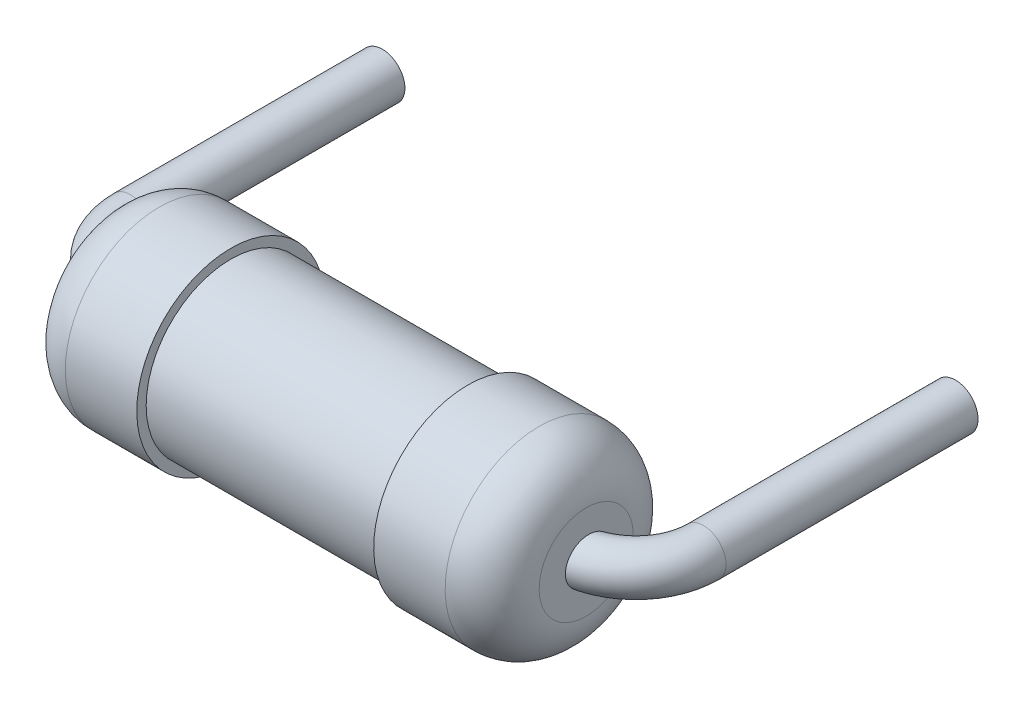
ISO-10303-21;
HEADER;
FILE_DESCRIPTION(('STEP AP214'),'2;1');
FILE_NAME('part.step','',(''),(''),'','','');
FILE_SCHEMA(('AUTOMOTIVE_DESIGN { 1 0 10303 214 1 1 1 1 }'));
ENDSEC;
DATA;
#1=APPLICATION_CONTEXT('core data for automotive mechanical design processes');
#2=APPLICATION_PROTOCOL_DEFINITION('international standard','automotive_design',2000,#1);
#3=PRODUCT_CONTEXT('',#1,'mechanical');
#4=PRODUCT('Part','Part','',(#3));
#5=PRODUCT_RELATED_PRODUCT_CATEGORY('part','',(#4));
#6=PRODUCT_DEFINITION_FORMATION('','',#4);
#7=PRODUCT_DEFINITION_CONTEXT('part definition',#1,'design');
#8=PRODUCT_DEFINITION('design','',#6,#7);
#9=PRODUCT_DEFINITION_SHAPE('','',#8);
#10=(LENGTH_UNIT() NAMED_UNIT(*) SI_UNIT(.MILLI.,.METRE.));
#11=(NAMED_UNIT(*) PLANE_ANGLE_UNIT() SI_UNIT($,.RADIAN.));
#12=(NAMED_UNIT(*) SI_UNIT($,.STERADIAN.) SOLID_ANGLE_UNIT());
#13=UNCERTAINTY_MEASURE_WITH_UNIT(LENGTH_MEASURE(1.E-05),#10,'distance_accuracy_value','');
#14=(GEOMETRIC_REPRESENTATION_CONTEXT(3) GLOBAL_UNCERTAINTY_ASSIGNED_CONTEXT((#13)) GLOBAL_UNIT_ASSIGNED_CONTEXT((#10,
#11,#12)) REPRESENTATION_CONTEXT('',''));
#15=CARTESIAN_POINT('',(0.,0.,0.));
#16=DIRECTION('',(0.,0.,1.));
#17=DIRECTION('',(1.,0.,0.));
#18=AXIS2_PLACEMENT_3D('',#15,#16,#17);
#19=CARTESIAN_POINT('',(7.32,0.,-3.));
#20=DIRECTION('',(0.,0.,1.));
#21=DIRECTION('',(1.,0.,0.));
#22=AXIS2_PLACEMENT_3D('',#19,#20,#21);
#23=PLANE('',#22);
#24=CARTESIAN_POINT('',(7.62,0.,-3.));
#25=DIRECTION('',(0.,0.,-1.));
#26=DIRECTION('',(-1.,0.,0.));
#27=AXIS2_PLACEMENT_3D('',#24,#25,#26);
#28=CIRCLE('',#27,0.3);
#29=CARTESIAN_POINT('',(7.32,0.,-3.));
#30=VERTEX_POINT('',#29);
#31=EDGE_CURVE('E11',#30,#30,#28,.T.);
#32=ORIENTED_EDGE('',*,*,#31,.T.);
#33=EDGE_LOOP('',(#32));
#34=FACE_BOUND('',#33,.T.);
#35=ADVANCED_FACE('F17',(#34),#23,.F.);
#36=CARTESIAN_POINT('',(7.62,0.,0.35));
#37=DIRECTION('',(0.,0.,-1.));
#38=DIRECTION('',(-1.,0.,0.));
#39=AXIS2_PLACEMENT_3D('',#36,#37,#38);
#40=CYLINDRICAL_SURFACE('',#39,0.3);
#41=DIRECTION('',(0.,0.,-1.));
#42=VECTOR('',#41,1.);
#43=CARTESIAN_POINT('',(7.32,0.,0.35));
#44=LINE('',#43,#42);
#45=CARTESIAN_POINT('',(7.32,0.,0.35));
#46=VERTEX_POINT('',#45);
#47=EDGE_CURVE('E25',#46,#30,#44,.T.);
#48=ORIENTED_EDGE('',*,*,#47,.T.);
#49=ORIENTED_EDGE('',*,*,#31,.F.);
#50=ORIENTED_EDGE('',*,*,#47,.F.);
#51=CARTESIAN_POINT('',(7.62,0.,0.35));
#52=DIRECTION('',(0.,0.,1.));
#53=DIRECTION('',(1.,0.,0.));
#54=AXIS2_PLACEMENT_3D('',#51,#52,#53);
#55=CIRCLE('',#54,0.3);
#56=EDGE_CURVE('E162',#46,#46,#55,.T.);
#57=ORIENTED_EDGE('',*,*,#56,.F.);
#58=EDGE_LOOP('',(#48,#49,#50,#57));
#59=FACE_BOUND('',#58,.T.);
#60=ADVANCED_FACE('F190',(#59),#40,.T.);
#61=CARTESIAN_POINT('',(6.72,0.,0.35));
#62=DIRECTION('',(0.,1.,0.));
#63=DIRECTION('',(0.,0.,1.));
#64=AXIS2_PLACEMENT_3D('',#61,#62,#63);
#65=TOROIDAL_SURFACE('',#64,0.9,0.3);
#66=CARTESIAN_POINT('',(6.96,0.,0.899909083395));
#67=CARTESIAN_POINT('',(6.96,-0.009860167462582,0.89990896861));
#68=CARTESIAN_POINT('',(6.96,-0.0196044152314,0.900333777569));
#69=CARTESIAN_POINT('',(6.96,-0.02906856746895,0.901162791225));
#70=CARTESIAN_POINT('',(6.96,-0.03818494668051,0.902337445313));
#71=CARTESIAN_POINT('',(6.96,-0.04697397432956,0.903804960014));
#72=CARTESIAN_POINT('',(6.96,-0.0654122858756,0.907588661461));
#73=CARTESIAN_POINT('',(6.96,-0.07491985816654,0.909985989386));
#74=CARTESIAN_POINT('',(6.96,-0.08408849098391,0.912709553602));
#75=CARTESIAN_POINT('',(6.96,-0.09294310465939,0.915726321464));
#76=CARTESIAN_POINT('',(6.96,-0.10150496885,0.919011549987));
#77=CARTESIAN_POINT('',(6.96,-0.118958221281,0.926453836747));
#78=CARTESIAN_POINT('',(6.96,-0.127787715696,0.930666010737));
#79=CARTESIAN_POINT('',(6.96,-0.136306161655,0.935155928941));
#80=CARTESIAN_POINT('',(6.96,-0.144532121634,0.939904049757));
#81=CARTESIAN_POINT('',(6.96,-0.152479877126,0.944895641374));
#82=CARTESIAN_POINT('',(6.96,-0.168328600516,0.955672815412));
#83=CARTESIAN_POINT('',(6.96,-0.176194773963,0.961488214941));
#84=CARTESIAN_POINT('',(6.96,-0.183772608747,0.967551566344));
#85=CARTESIAN_POINT('',(6.96,-0.191071765541,0.973851742068));
#86=CARTESIAN_POINT('',(6.96,-0.198098606692,0.980379951052));
#87=CARTESIAN_POINT('',(6.96,-0.211800202804,0.994065659178));
#88=CARTESIAN_POINT('',(6.96,-0.218460270558,1.001234983766));
#89=CARTESIAN_POINT('',(6.96,-0.224839910615,1.00863041136));
#90=CARTESIAN_POINT('',(6.96,-0.230940211566,1.016245364777));
#91=CARTESIAN_POINT('',(6.96,-0.236759839456,1.024073990789));
#92=CARTESIAN_POINT('',(6.96,-0.247832003876,1.040150861324));
#93=CARTESIAN_POINT('',(6.96,-0.253084568675,1.048398903269));
#94=CARTESIAN_POINT('',(6.96,-0.258049049185,1.05685004652));
#95=CARTESIAN_POINT('',(6.96,-0.2627200155,1.065498685566));
#96=CARTESIAN_POINT('',(6.96,-0.267090290802,1.074338848812));
#97=CARTESIAN_POINT('',(6.96,-0.275134913375,1.092219064394));
#98=CARTESIAN_POINT('',(6.96,-0.278821000575,1.10125194666));
#99=CARTESIAN_POINT('',(6.96,-0.282200788118,1.110456818481));
#100=CARTESIAN_POINT('',(6.96,-0.285264726102,1.119826534893));
#101=CARTESIAN_POINT('',(6.96,-0.288002139566,1.129352832871));
#102=CARTESIAN_POINT('',(6.96,-0.292725370416,1.148397637921));
#103=CARTESIAN_POINT('',(6.96,-0.29473215882,1.157906911838));
#104=CARTESIAN_POINT('',(6.96,-0.296410834199,1.16754558505));
#105=CARTESIAN_POINT('',(6.96,-0.297750172302,1.177303521997));
#106=CARTESIAN_POINT('',(6.96,-0.298738484134,1.187169019587));
#107=CARTESIAN_POINT('',(6.96,-0.29996489055,1.20670853133));
#108=CARTESIAN_POINT('',(6.96,-0.300230362775,1.216375375657));
#109=CARTESIAN_POINT('',(6.96,-0.300149187552,1.22611747583));
#110=CARTESIAN_POINT('',(6.96,-0.299710732489,1.235921267953));
#111=CARTESIAN_POINT('',(6.96,-0.298904577874,1.245771488577));
#112=CARTESIAN_POINT('',(6.96,-0.296585075031,1.265125180201));
#113=CARTESIAN_POINT('',(6.96,-0.295102319855,1.27462625024));
#114=CARTESIAN_POINT('',(6.96,-0.293263243612,1.284139361954));
#115=CARTESIAN_POINT('',(6.96,-0.29105964956,1.293647958229));
#116=CARTESIAN_POINT('',(6.96,-0.288484151749,1.303133947704));
#117=CARTESIAN_POINT('',(6.96,-0.282698057797,1.321631888118));
#118=CARTESIAN_POINT('',(6.96,-0.279518212828,1.330647292743));
#119=CARTESIAN_POINT('',(6.96,-0.275984865526,1.339606568389));
#120=CARTESIAN_POINT('',(6.96,-0.27209347283,1.348491205415));
#121=CARTESIAN_POINT('',(6.96,-0.26784072321,1.357281534804));
#122=CARTESIAN_POINT('',(6.96,-0.258792456003,1.374285939199));
#123=CARTESIAN_POINT('',(6.96,-0.254025471274,1.382509099941));
#124=CARTESIAN_POINT('',(6.96,-0.248921774536,1.390607746147));
#125=CARTESIAN_POINT('',(6.96,-0.24348099529,1.398562707415));
#126=CARTESIAN_POINT('',(6.96,-0.237704200488,1.406354107177));
#127=CARTESIAN_POINT('',(6.96,-0.225715116467,1.421280374005));
#128=CARTESIAN_POINT('',(6.96,-0.219527700064,1.428429026844));
#129=CARTESIAN_POINT('',(6.96,-0.213033898729,1.435388985848));
#130=CARTESIAN_POINT('',(6.96,-0.206237442407,1.442141620875));
#131=CARTESIAN_POINT('',(6.96,-0.199143537578,1.448668007007));
#132=CARTESIAN_POINT('',(6.96,-0.184639358866,1.461004311837));
#133=CARTESIAN_POINT('',(6.96,-0.177249661366,1.46683162664));
#134=CARTESIAN_POINT('',(6.96,-0.169595743404,1.472413651413));
#135=CARTESIAN_POINT('',(6.96,-0.161685063001,1.477733185029));
#136=CARTESIAN_POINT('',(6.96,-0.153526567552,1.482773042789));
#137=CARTESIAN_POINT('',(6.96,-0.137020377957,1.492097733275));
#138=CARTESIAN_POINT('',(6.96,-0.128688741655,1.496402506097));
#139=CARTESIAN_POINT('',(6.96,-0.120145015698,1.500414870926));
#140=CARTESIAN_POINT('',(6.96,-0.111400273136,1.504119613979));
#141=CARTESIAN_POINT('',(6.96,-0.102467429294,1.507501811642));
#142=CARTESIAN_POINT('',(6.96,-0.08453487359643,1.513498183633));
#143=CARTESIAN_POINT('',(6.96,-0.07554644720911,1.51613308184));
#144=CARTESIAN_POINT('',(6.96,-0.06640854708582,1.518437839156));
#145=CARTESIAN_POINT('',(6.96,-0.05713780068804,1.520399910874));
#146=CARTESIAN_POINT('',(6.96,-0.04775487845774,1.522007893513));
#147=CARTESIAN_POINT('',(6.96,-0.02969292548283,1.52437977876));
#148=CARTESIAN_POINT('',(6.96,-0.02102889094976,1.525208924822));
#149=CARTESIAN_POINT('',(6.96,-0.01231404153143,1.525730890851));
#150=CARTESIAN_POINT('',(6.96,-0.003572679276074,1.525941220805));
#151=CARTESIAN_POINT('',(6.96,0.005168243033088,1.52583907475));
#152=CARTESIAN_POINT('',(6.96,0.02337844678287,1.524978413229));
#153=CARTESIAN_POINT('',(6.96,0.03284373024997,1.524160868463));
#154=CARTESIAN_POINT('',(6.96,0.04224172239025,1.522980299422));
#155=CARTESIAN_POINT('',(6.96,0.05154503802108,1.521444853212));
#156=CARTESIAN_POINT('',(6.96,0.06073215666605,1.519565119195));
#157=CARTESIAN_POINT('',(6.96,0.07909771199475,1.515080715405));
#158=CARTESIAN_POINT('',(6.96,0.0882675531125,1.512456387335));
#159=CARTESIAN_POINT('',(6.96,0.09727920151967,1.509494357792));
#160=CARTESIAN_POINT('',(6.96,0.106117302403,1.506208331254));
#161=CARTESIAN_POINT('',(6.96,0.114768890523,1.502612503667));
#162=CARTESIAN_POINT('',(6.96,0.1319661163,1.494697932395));
#163=CARTESIAN_POINT('',(6.96,0.140497712216,1.490358583428));
#164=CARTESIAN_POINT('',(6.96,0.148806071355,1.485719654426));
#165=CARTESIAN_POINT('',(6.96,0.156880646133,1.480797412311));
#166=CARTESIAN_POINT('',(6.96,0.164712447986,1.475608252032));
#167=CARTESIAN_POINT('',(6.96,0.180151425777,1.46453127229));
#168=CARTESIAN_POINT('',(6.96,0.187739967164,1.45862481836));
#169=CARTESIAN_POINT('',(6.96,0.195051332691,1.452467727028));
#170=CARTESIAN_POINT('',(6.96,0.20207865613,1.446078243141));
#171=CARTESIAN_POINT('',(6.96,0.208816543867,1.439474464151));
#172=CARTESIAN_POINT('',(6.96,0.221953238059,1.425612923524));
#173=CARTESIAN_POINT('',(6.96,0.228328994524,1.418339683896));
#174=CARTESIAN_POINT('',(6.96,0.234383964852,1.410874723556));
#175=CARTESIAN_POINT('',(6.96,0.240115238483,1.403237627432));
#176=CARTESIAN_POINT('',(6.96,0.245521373748,1.395447463058));
#177=CARTESIAN_POINT('',(6.96,0.25588986733,1.379276120213));
#178=CARTESIAN_POINT('',(6.96,0.260825161615,1.370883687614));
#179=CARTESIAN_POINT('',(6.96,0.265408347201,1.362366366749));
#180=CARTESIAN_POINT('',(6.96,0.269640836772,1.353744077057));
#181=CARTESIAN_POINT('',(6.96,0.273525389215,1.345035773446));
#182=CARTESIAN_POINT('',(6.96,0.280757370989,1.327109983642));
#183=CARTESIAN_POINT('',(6.96,0.284074778857,1.317886520225));
#184=CARTESIAN_POINT('',(6.96,0.28702301626,1.308609389122));
#185=CARTESIAN_POINT('',(6.96,0.289607785113,1.29929753334));
#186=CARTESIAN_POINT('',(6.96,0.291835806202,1.289968505808));
#187=CARTESIAN_POINT('',(6.96,0.295674983107,1.270905490066));
#188=CARTESIAN_POINT('',(6.96,0.297255138129,1.261171409814));
#189=CARTESIAN_POINT('',(6.96,0.298464076807,1.251454505978));
#190=CARTESIAN_POINT('',(6.96,0.299311079865,1.241771395371));
#191=CARTESIAN_POINT('',(6.96,0.299805916194,1.232137034265));
#192=CARTESIAN_POINT('',(6.96,0.300118111197,1.212595339038));
#193=CARTESIAN_POINT('',(6.96,0.299906304864,1.202693342182));
#194=CARTESIAN_POINT('',(6.96,0.299334986276,1.192873677979));
#195=CARTESIAN_POINT('',(6.96,0.298415549391,1.183149632812));
#196=CARTESIAN_POINT('',(6.96,0.29715921972,1.173532829284));
#197=CARTESIAN_POINT('',(6.96,0.293937801394,1.154190874));
#198=CARTESIAN_POINT('',(6.96,0.291948588365,1.144474495238));
#199=CARTESIAN_POINT('',(6.96,0.28962167445,1.134895115228));
#200=CARTESIAN_POINT('',(6.96,0.286968474246,1.125462408515));
#201=CARTESIAN_POINT('',(6.96,0.283999557728,1.116184698885));
#202=CARTESIAN_POINT('',(6.96,0.277365720041,1.097719338125));
#203=CARTESIAN_POINT('',(6.96,0.273684735103,1.088540329457));
#204=CARTESIAN_POINT('',(6.96,0.269692170683,1.079539418357));
#205=CARTESIAN_POINT('',(6.96,0.265397023465,1.070723360764));
#206=CARTESIAN_POINT('',(6.96,0.260806811571,1.062098183552));
#207=CARTESIAN_POINT('',(6.96,0.251004219697,1.045163947022));
#208=CARTESIAN_POINT('',(6.96,0.245786411547,1.036858741787));
#209=CARTESIAN_POINT('',(6.96,0.240280395782,1.028758943151));
#210=CARTESIAN_POINT('',(6.96,0.234490304979,1.02087012779));
#211=CARTESIAN_POINT('',(6.96,0.22841815861,1.013198074729));
#212=CARTESIAN_POINT('',(6.96,0.215801547815,0.998407234883));
#213=CARTESIAN_POINT('',(6.96,0.209264913083,0.99128247471));
#214=CARTESIAN_POINT('',(6.96,0.202454000094,0.984380026053));
#215=CARTESIAN_POINT('',(6.96,0.195365961507,0.977706983911));
#216=CARTESIAN_POINT('',(6.96,0.187995061392,0.971271997058));
#217=CARTESIAN_POINT('',(6.96,0.173012837564,0.959175029375));
#218=CARTESIAN_POINT('',(6.96,0.165426529007,0.953492099376));
#219=CARTESIAN_POINT('',(6.96,0.157566437944,0.948044934321));
#220=CARTESIAN_POINT('',(6.96,0.149421373308,0.942845601948));
#221=CARTESIAN_POINT('',(6.96,0.140976264593,0.937909781461));
#222=CARTESIAN_POINT('',(6.96,0.124148131162,0.928975627958));
#223=CARTESIAN_POINT('',(6.96,0.115814071992,0.924934439518));
#224=CARTESIAN_POINT('',(6.96,0.107194037794,0.921149181784));
#225=CARTESIAN_POINT('',(6.96,0.09826937450524,0.917639774974));
#226=CARTESIAN_POINT('',(6.96,0.08901696421491,0.914432828225));
#227=CARTESIAN_POINT('',(6.96,0.06762356037127,0.908046964389));
#228=CARTESIAN_POINT('',(6.96,0.05540377745077,0.905068595899));
#229=CARTESIAN_POINT('',(6.96,0.04253681255711,0.902629529668));
#230=CARTESIAN_POINT('',(6.96,0.02893994360873,0.900849442899));
#231=CARTESIAN_POINT('',(6.96,0.0146772221458,0.899909046356));
#232=CARTESIAN_POINT('',(6.96,0.,0.899909083395));
#233=(BOUNDED_CURVE() B_SPLINE_CURVE(6,(#66,#67,#68,#69,#70,#71,#72,#73,#74,#75,#76,#77,#78,#79,
#80,#81,#82,#83,#84,#85,#86,#87,#88,#89,#90,#91,#92,#93,#94,#95,#96,#97,#98,#99,#100,#101,#102,
#103,#104,#105,#106,#107,#108,#109,#110,#111,#112,#113,#114,#115,#116,#117,#118,#119,#120,#121,
#122,#123,#124,#125,#126,#127,#128,#129,#130,#131,#132,#133,#134,#135,#136,#137,#138,#139,#140,
#141,#142,#143,#144,#145,#146,#147,#148,#149,#150,#151,#152,#153,#154,#155,#156,#157,#158,#159,
#160,#161,#162,#163,#164,#165,#166,#167,#168,#169,#170,#171,#172,#173,#174,#175,#176,#177,#178,
#179,#180,#181,#182,#183,#184,#185,#186,#187,#188,#189,#190,#191,#192,#193,#194,#195,#196,#197,
#198,#199,#200,#201,#202,#203,#204,#205,#206,#207,#208,#209,#210,#211,#212,#213,#214,#215,#216,
#217,#218,#219,#220,#221,#222,#223,#224,#225,#226,#227,#228,#229,#230,#231,#232),.UNSPECIFIED.,
.T.,.F.) B_SPLINE_CURVE_WITH_KNOTS((7,5,5,5,5,5,5,5,5,5,5,5,5,5,5,5,5,5,5,5,5,5,5,5,5,5,5,5,5,5,
5,5,5,7),(0.,0.02522151735631,0.05431626764274,0.08648932873413,0.120698905604,0.15585219498,
0.191016701755,0.225517033144,0.258939642143,0.291086884381,0.32191412294,0.351469698498,
0.379846555914,0.407148198058,0.433469525493,0.458895614127,0.483540398702,0.505898369155,
0.530279933853,0.555348100008,0.581270886766,0.608136607836,0.636034631737,0.665066137875,
0.695331933304,0.726904811218,0.759787311372,0.793856187529,0.828799116201,0.864057997078,
0.898806507422,0.932001552493,0.962545077037,1.),
.UNSPECIFIED.) CURVE() GEOMETRIC_REPRESENTATION_ITEM() RATIONAL_B_SPLINE_CURVE((1.,1.,1.,1.,1.,
1.,1.,1.,1.,1.,1.,1.,1.,1.,1.,1.,1.,1.,1.,1.,1.,1.,1.,1.,1.,1.,1.,1.,1.,1.,1.,1.,1.,1.,1.,1.,1.,
1.,1.,1.,1.,1.,1.,1.,1.,1.,1.,1.,1.,1.,1.,1.,1.,1.,1.,1.,1.,1.,1.,1.,1.,1.,1.,1.,1.,1.,1.,1.,1.,
1.,1.,1.,1.,1.,1.,1.,1.,1.,1.,1.,1.,1.,1.,1.,1.,1.,1.,1.,1.,1.,1.,1.,1.,1.,1.,1.,1.,1.,1.,1.,1.,
1.,1.,1.,1.,1.,1.,1.,1.,1.,1.,1.,1.,1.,1.,1.,1.,1.,1.,1.,1.,1.,1.,1.,1.,1.,1.,1.,1.,1.,1.,1.,1.,
1.,1.,1.,1.,1.,1.,1.,1.,1.,1.,1.,1.,1.,1.,1.,1.,1.,1.,1.,1.,1.,1.,1.,1.,1.,1.,1.,1.,1.,1.,1.,1.,
1.,1.)) REPRESENTATION_ITEM(''));
#234=CARTESIAN_POINT('',(6.96,0.,0.899909083395));
#235=VERTEX_POINT('',#234);
#236=EDGE_CURVE('E173',#235,#235,#233,.T.);
#237=ORIENTED_EDGE('',*,*,#236,.F.);
#238=CARTESIAN_POINT('',(6.72,0.,0.35));
#239=DIRECTION('',(0.,1.,0.));
#240=DIRECTION('',(0.,0.,1.));
#241=AXIS2_PLACEMENT_3D('',#238,#239,#240);
#242=CIRCLE('',#241,0.6);
#243=EDGE_CURVE('E179',#235,#46,#242,.T.);
#244=ORIENTED_EDGE('',*,*,#243,.T.);
#245=ORIENTED_EDGE('',*,*,#56,.T.);
#246=ORIENTED_EDGE('',*,*,#243,.F.);
#247=EDGE_LOOP('',(#237,#244,#245,#246));
#248=FACE_BOUND('',#247,.T.);
#249=ADVANCED_FACE('F189',(#248),#65,.T.);
#250=CARTESIAN_POINT('',(6.96,1.25,1.25));
#251=DIRECTION('',(-1.,0.,0.));
#252=DIRECTION('',(0.,0.,1.));
#253=AXIS2_PLACEMENT_3D('',#250,#251,#252);
#254=PLANE('',#253);
#255=ORIENTED_EDGE('',*,*,#236,.T.);
#256=EDGE_LOOP('',(#255));
#257=FACE_BOUND('',#256,.T.);
#258=CARTESIAN_POINT('',(6.96,0.,1.25));
#259=DIRECTION('',(1.,0.,0.));
#260=DIRECTION('',(0.,1.,0.));
#261=AXIS2_PLACEMENT_3D('',#258,#259,#260);
#262=CIRCLE('',#261,0.625);
#263=CARTESIAN_POINT('',(6.96,0.625,1.25));
#264=VERTEX_POINT('',#263);
#265=EDGE_CURVE('E127',#264,#264,#262,.T.);
#266=ORIENTED_EDGE('',*,*,#265,.T.);
#267=EDGE_LOOP('',(#266));
#268=FACE_BOUND('',#267,.T.);
#269=ADVANCED_FACE('F198',(#257,#268),#254,.F.);
#270=CARTESIAN_POINT('',(6.335,0.,1.25));
#271=DIRECTION('',(1.,0.,0.));
#272=DIRECTION('',(0.,1.,0.));
#273=AXIS2_PLACEMENT_3D('',#270,#271,#272);
#274=DEGENERATE_TOROIDAL_SURFACE('',#273,0.625,0.625,.T.);
#275=CARTESIAN_POINT('',(6.335,0.625,1.25));
#276=DIRECTION('',(0.,0.,-1.));
#277=DIRECTION('',(0.,1.,0.));
#278=AXIS2_PLACEMENT_3D('',#275,#276,#277);
#279=CIRCLE('',#278,0.625);
#280=CARTESIAN_POINT('',(6.335,1.25,1.25));
#281=VERTEX_POINT('',#280);
#282=EDGE_CURVE('E124',#281,#264,#279,.T.);
#283=ORIENTED_EDGE('',*,*,#282,.F.);
#284=CARTESIAN_POINT('',(6.335,0.,1.25));
#285=DIRECTION('',(1.,0.,0.));
#286=DIRECTION('',(0.,1.,0.));
#287=AXIS2_PLACEMENT_3D('',#284,#285,#286);
#288=CIRCLE('',#287,1.25);
#289=EDGE_CURVE('E128',#281,#281,#288,.T.);
#290=ORIENTED_EDGE('',*,*,#289,.T.);
#291=ORIENTED_EDGE('',*,*,#282,.T.);
#292=ORIENTED_EDGE('',*,*,#265,.F.);
#293=EDGE_LOOP('',(#283,#290,#291,#292));
#294=FACE_BOUND('',#293,.T.);
#295=ADVANCED_FACE('F202',(#294),#274,.T.);
#296=CARTESIAN_POINT('',(0.3,0.,-3.));
#297=DIRECTION('',(0.,0.,-1.));
#298=DIRECTION('',(0.,-1.,0.));
#299=AXIS2_PLACEMENT_3D('',#296,#297,#298);
#300=PLANE('',#299);
#301=CARTESIAN_POINT('',(0.,0.,-3.));
#302=DIRECTION('',(0.,0.,1.));
#303=DIRECTION('',(1.,0.,0.));
#304=AXIS2_PLACEMENT_3D('',#301,#302,#303);
#305=CIRCLE('',#304,0.3);
#306=CARTESIAN_POINT('',(0.3,0.,-3.));
#307=VERTEX_POINT('',#306);
#308=EDGE_CURVE('E137',#307,#307,#305,.T.);
#309=ORIENTED_EDGE('',*,*,#308,.F.);
#310=EDGE_LOOP('',(#309));
#311=FACE_BOUND('',#310,.T.);
#312=ADVANCED_FACE('F206',(#311),#300,.T.);
#313=CARTESIAN_POINT('',(5.385,0.,1.25));
#314=DIRECTION('',(-1.,0.,0.));
#315=DIRECTION('',(0.,1.,0.));
#316=AXIS2_PLACEMENT_3D('',#313,#314,#315);
#317=CYLINDRICAL_SURFACE('',#316,1.25);
#318=CARTESIAN_POINT('',(5.385,0.,1.25));
#319=DIRECTION('',(1.,0.,0.));
#320=DIRECTION('',(0.,1.,0.));
#321=AXIS2_PLACEMENT_3D('',#318,#319,#320);
#322=CIRCLE('',#321,1.25);
#323=CARTESIAN_POINT('',(5.385,1.25,1.25));
#324=VERTEX_POINT('',#323);
#325=EDGE_CURVE('E138',#324,#324,#322,.T.);
#326=ORIENTED_EDGE('',*,*,#325,.T.);
#327=DIRECTION('',(1.,0.,0.));
#328=VECTOR('',#327,1.);
#329=CARTESIAN_POINT('',(5.385,1.25,1.25));
#330=LINE('',#329,#328);
#331=EDGE_CURVE('E144',#324,#281,#330,.T.);
#332=ORIENTED_EDGE('',*,*,#331,.T.);
#333=ORIENTED_EDGE('',*,*,#289,.F.);
#334=ORIENTED_EDGE('',*,*,#331,.F.);
#335=EDGE_LOOP('',(#326,#332,#333,#334));
#336=FACE_BOUND('',#335,.T.);
#337=ADVANCED_FACE('F212',(#336),#317,.T.);
#338=CARTESIAN_POINT('',(0.,0.,-3.));
#339=DIRECTION('',(0.,0.,1.));
#340=DIRECTION('',(1.,0.,0.));
#341=AXIS2_PLACEMENT_3D('',#338,#339,#340);
#342=CYLINDRICAL_SURFACE('',#341,0.3);
#343=DIRECTION('',(0.,0.,1.));
#344=VECTOR('',#343,1.);
#345=CARTESIAN_POINT('',(0.3,0.,-3.));
#346=LINE('',#345,#344);
#347=CARTESIAN_POINT('',(0.3,0.,0.35));
#348=VERTEX_POINT('',#347);
#349=EDGE_CURVE('E134',#307,#348,#346,.T.);
#350=ORIENTED_EDGE('',*,*,#349,.T.);
#351=CARTESIAN_POINT('',(0.,0.,0.35));
#352=DIRECTION('',(0.,0.,1.));
#353=DIRECTION('',(1.,0.,0.));
#354=AXIS2_PLACEMENT_3D('',#351,#352,#353);
#355=CIRCLE('',#354,0.3);
#356=EDGE_CURVE('E122',#348,#348,#355,.T.);
#357=ORIENTED_EDGE('',*,*,#356,.F.);
#358=ORIENTED_EDGE('',*,*,#349,.F.);
#359=ORIENTED_EDGE('',*,*,#308,.T.);
#360=EDGE_LOOP('',(#350,#357,#358,#359));
#361=FACE_BOUND('',#360,.T.);
#362=ADVANCED_FACE('F208',(#361),#342,.T.);
#363=CARTESIAN_POINT('',(5.385,1.25,1.25));
#364=DIRECTION('',(-1.,0.,0.));
#365=DIRECTION('',(0.,0.,1.));
#366=AXIS2_PLACEMENT_3D('',#363,#364,#365);
#367=PLANE('',#366);
#368=CARTESIAN_POINT('',(5.385,0.,1.25));
#369=DIRECTION('',(-1.,0.,0.));
#370=DIRECTION('',(0.,1.,0.));
#371=AXIS2_PLACEMENT_3D('',#368,#369,#370);
#372=CIRCLE('',#371,1.125);
#373=CARTESIAN_POINT('',(5.385,1.125,1.25));
#374=VERTEX_POINT('',#373);
#375=EDGE_CURVE('E123',#374,#374,#372,.T.);
#376=ORIENTED_EDGE('',*,*,#375,.F.);
#377=EDGE_LOOP('',(#376));
#378=FACE_BOUND('',#377,.T.);
#379=ORIENTED_EDGE('',*,*,#325,.F.);
#380=EDGE_LOOP('',(#379));
#381=FACE_BOUND('',#380,.T.);
#382=ADVANCED_FACE('F211',(#378,#381),#367,.T.);
#383=CARTESIAN_POINT('',(0.9,0.,0.35));
#384=DIRECTION('',(0.,1.,0.));
#385=DIRECTION('',(-1.,0.,0.));
#386=AXIS2_PLACEMENT_3D('',#383,#384,#385);
#387=TOROIDAL_SURFACE('',#386,0.9,0.3);
#388=ORIENTED_EDGE('',*,*,#356,.T.);
#389=CARTESIAN_POINT('',(0.9,0.,0.35));
#390=DIRECTION('',(0.,1.,0.));
#391=DIRECTION('',(-1.,0.,0.));
#392=AXIS2_PLACEMENT_3D('',#389,#390,#391);
#393=CIRCLE('',#392,0.6);
#394=CARTESIAN_POINT('',(0.66,0.,0.899909083395));
#395=VERTEX_POINT('',#394);
#396=EDGE_CURVE('E157',#348,#395,#393,.T.);
#397=ORIENTED_EDGE('',*,*,#396,.T.);
#398=CARTESIAN_POINT('',(0.66,0.,0.899909083395));
#399=CARTESIAN_POINT('',(0.66,-0.009861963323296,0.899909084471));
#400=CARTESIAN_POINT('',(0.66,-0.01960383099012,0.900333558971));
#401=CARTESIAN_POINT('',(0.66,-0.0290667633729,0.901163095205));
#402=CARTESIAN_POINT('',(0.66,-0.03818473840012,0.902336888075));
#403=CARTESIAN_POINT('',(0.66,-0.04697555886318,0.903805406252));
#404=CARTESIAN_POINT('',(0.66,-0.06541217845247,0.907588617289));
#405=CARTESIAN_POINT('',(0.66,-0.07491989955217,0.909985996381));
#406=CARTESIAN_POINT('',(0.66,-0.08408858685729,0.912709602459));
#407=CARTESIAN_POINT('',(0.66,-0.0929431150905,0.915726339128));
#408=CARTESIAN_POINT('',(0.66,-0.101504886237,0.919011492948));
#409=CARTESIAN_POINT('',(0.66,-0.118958160976,0.926453793498));
#410=CARTESIAN_POINT('',(0.66,-0.127787740677,0.930666021227));
#411=CARTESIAN_POINT('',(0.66,-0.136306213845,0.935155972835));
#412=CARTESIAN_POINT('',(0.66,-0.144532125259,0.939904061777));
#413=CARTESIAN_POINT('',(0.66,-0.152479834979,0.944895594586));
#414=CARTESIAN_POINT('',(0.66,-0.168328675181,0.955672717204));
#415=CARTESIAN_POINT('',(0.66,-0.176194628708,0.961488338811));
#416=CARTESIAN_POINT('',(0.66,-0.183772627725,0.967551590964));
#417=CARTESIAN_POINT('',(0.66,-0.191071921446,0.973851630909));
#418=CARTESIAN_POINT('',(0.66,-0.19809849539,0.980379998969));
#419=CARTESIAN_POINT('',(0.66,-0.211800252103,0.99406561399));
#420=CARTESIAN_POINT('',(0.66,-0.218460183619,1.001235038361));
#421=CARTESIAN_POINT('',(0.66,-0.224839916669,1.008630424477));
#422=CARTESIAN_POINT('',(0.66,-0.230940302033,1.016245317007));
#423=CARTESIAN_POINT('',(0.66,-0.236759778797,1.024074009311));
#424=CARTESIAN_POINT('',(0.66,-0.247832030244,1.040150827903));
#425=CARTESIAN_POINT('',(0.66,-0.253084597548,1.048398894868));
#426=CARTESIAN_POINT('',(0.66,-0.258049056373,1.056850063306));
#427=CARTESIAN_POINT('',(0.66,-0.262719990238,1.065498702059));
#428=CARTESIAN_POINT('',(0.66,-0.267090249501,1.07433884651));
#429=CARTESIAN_POINT('',(0.66,-0.275134936213,1.092219038761));
#430=CARTESIAN_POINT('',(0.66,-0.278821023102,1.101251941956));
#431=CARTESIAN_POINT('',(0.66,-0.282200792082,1.110456832947));
#432=CARTESIAN_POINT('',(0.66,-0.285264705632,1.119826546568));
#433=CARTESIAN_POINT('',(0.66,-0.288002108658,1.129352827713));
#434=CARTESIAN_POINT('',(0.66,-0.29272539517,1.148397615962));
#435=CARTESIAN_POINT('',(0.66,-0.29473218058,1.157906910826));
#436=CARTESIAN_POINT('',(0.66,-0.296410836061,1.167545600214));
#437=CARTESIAN_POINT('',(0.66,-0.297750151594,1.177303530334));
#438=CARTESIAN_POINT('',(0.66,-0.298738455802,1.187169009313));
#439=CARTESIAN_POINT('',(0.66,-0.299964918417,1.206708514181));
#440=CARTESIAN_POINT('',(0.66,-0.300230384291,1.216375379318));
#441=CARTESIAN_POINT('',(0.66,-0.300149186912,1.226117491764));
#442=CARTESIAN_POINT('',(0.66,-0.299710710819,1.235921272022));
#443=CARTESIAN_POINT('',(0.66,-0.298904551758,1.245771471938));
#444=CARTESIAN_POINT('',(0.66,-0.296585103724,1.265125169703));
#445=CARTESIAN_POINT('',(0.66,-0.295102339165,1.274626258325));
#446=CARTESIAN_POINT('',(0.66,-0.293263240337,1.284139377081));
#447=CARTESIAN_POINT('',(0.66,-0.291059628806,1.293647957516));
#448=CARTESIAN_POINT('',(0.66,-0.288484130363,1.303133926208));
#449=CARTESIAN_POINT('',(0.66,-0.282698083788,1.321631884472));
#450=CARTESIAN_POINT('',(0.66,-0.279518227914,1.330647303479));
#451=CARTESIAN_POINT('',(0.66,-0.275984860345,1.33960658093));
#452=CARTESIAN_POINT('',(0.66,-0.272093455342,1.348491200819));
#453=CARTESIAN_POINT('',(0.66,-0.267840708483,1.357281511993));
#454=CARTESIAN_POINT('',(0.66,-0.258792476906,1.374285940745));
#455=CARTESIAN_POINT('',(0.66,-0.254025481533,1.382509111114));
#456=CARTESIAN_POINT('',(0.66,-0.248921768643,1.390607755283));
#457=CARTESIAN_POINT('',(0.66,-0.243480982245,1.398562700734));
#458=CARTESIAN_POINT('',(0.66,-0.237704192262,1.406354086406));
#459=CARTESIAN_POINT('',(0.66,-0.22571513259,1.421280378602));
#460=CARTESIAN_POINT('',(0.66,-0.219527706492,1.428429037341));
#461=CARTESIAN_POINT('',(0.66,-0.213033892817,1.435388992124));
#462=CARTESIAN_POINT('',(0.66,-0.206237433156,1.442141613477));
#463=CARTESIAN_POINT('',(0.66,-0.199143534101,1.448667989237));
#464=CARTESIAN_POINT('',(0.66,-0.184639374507,1.46100431938));
#465=CARTESIAN_POINT('',(0.66,-0.177249666015,1.466831638372));
#466=CARTESIAN_POINT('',(0.66,-0.169595736209,1.472413656662));
#467=CARTESIAN_POINT('',(0.66,-0.161685054894,1.477733175901));
#468=CARTESIAN_POINT('',(0.66,-0.153526567249,1.482773024258));
#469=CARTESIAN_POINT('',(0.66,-0.137020407721,1.492097753386));
#470=CARTESIAN_POINT('',(0.66,-0.128688747003,1.496402530856));
#471=CARTESIAN_POINT('',(0.66,-0.12014499879,1.500414878928));
#472=CARTESIAN_POINT('',(0.66,-0.111400259626,1.504119593216));
#473=CARTESIAN_POINT('',(0.66,-0.102467435485,1.507501774849));
#474=CARTESIAN_POINT('',(0.66,-0.08453493192811,1.513498294635));
#475=CARTESIAN_POINT('',(0.66,-0.07554639694304,1.516132890753));
#476=CARTESIAN_POINT('',(0.66,-0.0664085144705,1.518437847791));
#477=CARTESIAN_POINT('',(0.66,-0.05713783351899,1.520400106432));
#478=CARTESIAN_POINT('',(0.66,-0.04775488525608,1.522007764907));
#479=CARTESIAN_POINT('',(0.66,-0.02969295309097,1.524379864025));
#480=CARTESIAN_POINT('',(0.66,-0.02102888075484,1.525208782901));
#481=CARTESIAN_POINT('',(0.66,-0.01231401679426,1.525730893697));
#482=CARTESIAN_POINT('',(0.66,-0.003572675622322,1.525941364018));
#483=CARTESIAN_POINT('',(0.66,0.005168222805428,1.525838983228));
#484=CARTESIAN_POINT('',(0.66,0.02337847467049,1.524978205181));
#485=CARTESIAN_POINT('',(0.66,0.03284375814827,1.524161190409));
#486=CARTESIAN_POINT('',(0.66,0.04224166817951,1.522980309203));
#487=CARTESIAN_POINT('',(0.66,0.05154498116248,1.52144453626));
#488=CARTESIAN_POINT('',(0.66,0.06073223707979,1.519565307122));
#489=CARTESIAN_POINT('',(0.66,0.07909772773064,1.515080653378));
#490=CARTESIAN_POINT('',(0.66,0.08826753248322,1.512456350085));
#491=CARTESIAN_POINT('',(0.66,0.09727917108862,1.509494369221));
#492=CARTESIAN_POINT('',(0.66,0.106117308319,1.506208374239));
#493=CARTESIAN_POINT('',(0.66,0.114768939441,1.502612541932));
#494=CARTESIAN_POINT('',(0.66,0.131966117695,1.494697909774));
#495=CARTESIAN_POINT('',(0.66,0.140497702999,1.490358571609));
#496=CARTESIAN_POINT('',(0.66,0.148806061897,1.485719660214));
#497=CARTESIAN_POINT('',(0.66,0.156880650792,1.480797427009));
#498=CARTESIAN_POINT('',(0.66,0.164712466725,1.47560826256));
#499=CARTESIAN_POINT('',(0.66,0.180151423764,1.464531255078));
#500=CARTESIAN_POINT('',(0.66,0.187739958872,1.458624810593));
#501=CARTESIAN_POINT('',(0.66,0.195051326582,1.452467732556));
#502=CARTESIAN_POINT('',(0.66,0.202078661493,1.446078253645));
#503=CARTESIAN_POINT('',(0.66,0.208816558921,1.439474469779));
#504=CARTESIAN_POINT('',(0.66,0.221953232148,1.425612904145));
#505=CARTESIAN_POINT('',(0.66,0.228328983313,1.41833967682));
#506=CARTESIAN_POINT('',(0.66,0.234383958936,1.410874731309));
#507=CARTESIAN_POINT('',(0.66,0.240115246881,1.403237638329));
#508=CARTESIAN_POINT('',(0.66,0.245521392347,1.395447466144));
#509=CARTESIAN_POINT('',(0.66,0.255889855564,1.379276097975));
#510=CARTESIAN_POINT('',(0.66,0.260825146013,1.370883681886));
#511=CARTESIAN_POINT('',(0.66,0.265408341569,1.362366377835));
#512=CARTESIAN_POINT('',(0.66,0.269640849736,1.353744088225));
#513=CARTESIAN_POINT('',(0.66,0.273525413156,1.345035772328));
#514=CARTESIAN_POINT('',(0.66,0.280757352367,1.327109961101));
#515=CARTESIAN_POINT('',(0.66,0.284074759274,1.317886517643));
#516=CARTESIAN_POINT('',(0.66,0.287023012024,1.308609403309));
#517=CARTESIAN_POINT('',(0.66,0.289607802772,1.299297542852));
#518=CARTESIAN_POINT('',(0.66,0.291835834134,1.289968498384));
#519=CARTESIAN_POINT('',(0.66,0.295674958709,1.270905470981));
#520=CARTESIAN_POINT('',(0.66,0.297255116553,1.261171411794));
#521=CARTESIAN_POINT('',(0.66,0.298464074992,1.251454521799));
#522=CARTESIAN_POINT('',(0.66,0.299311100714,1.241771401083));
#523=CARTESIAN_POINT('',(0.66,0.299805944827,1.232137019844));
#524=CARTESIAN_POINT('',(0.66,0.30011808361,1.212595326012));
#525=CARTESIAN_POINT('',(0.66,0.299906283631,1.202693348802));
#526=CARTESIAN_POINT('',(0.66,0.299334987113,1.192873693594));
#527=CARTESIAN_POINT('',(0.66,0.298415571185,1.183149633751));
#528=CARTESIAN_POINT('',(0.66,0.297159245916,1.173532809156));
#529=CARTESIAN_POINT('',(0.66,0.293937772017,1.154190866917));
#530=CARTESIAN_POINT('',(0.66,0.291948568133,1.144474505513));
#531=CARTESIAN_POINT('',(0.66,0.289621677512,1.134895129825));
#532=CARTESIAN_POINT('',(0.66,0.286968496105,1.125462405282));
#533=CARTESIAN_POINT('',(0.66,0.283999580964,1.116184674916));
#534=CARTESIAN_POINT('',(0.66,0.277365684897,1.097719334783));
#535=CARTESIAN_POINT('',(0.66,0.273684712853,1.08854034335));
#536=CARTESIAN_POINT('',(0.66,0.269692176119,1.079539433524));
#537=CARTESIAN_POINT('',(0.66,0.265397048483,1.07072335418));
#538=CARTESIAN_POINT('',(0.66,0.260806835513,1.062098154612));
#539=CARTESIAN_POINT('',(0.66,0.251004164416,1.045163946312));
#540=CARTESIAN_POINT('',(0.66,0.245786379559,1.036858764173));
#541=CARTESIAN_POINT('',(0.66,0.240280407048,1.028758964174));
#542=CARTESIAN_POINT('',(0.66,0.234490342534,1.020870115558));
#543=CARTESIAN_POINT('',(0.66,0.228418190257,1.013198030747));
#544=CARTESIAN_POINT('',(0.66,0.215801462132,0.998407266407));
#545=CARTESIAN_POINT('',(0.66,0.209265037039,0.991282398269));
#546=CARTESIAN_POINT('',(0.66,0.202454011648,0.98438004474));
#547=CARTESIAN_POINT('',(0.66,0.195365844133,0.977707070031));
#548=CARTESIAN_POINT('',(0.66,0.187995125017,0.971271927442));
#549=CARTESIAN_POINT('',(0.66,0.173012685338,0.959175110633));
#550=CARTESIAN_POINT('',(0.66,0.165426730288,0.953491920673));
#551=CARTESIAN_POINT('',(0.66,0.157566473117,0.948044968651));
#552=CARTESIAN_POINT('',(0.66,0.149421191466,0.9428457983));
#553=CARTESIAN_POINT('',(0.66,0.140976348171,0.937909629891));
#554=CARTESIAN_POINT('',(0.66,0.124148062588,0.928975570166));
#555=CARTESIAN_POINT('',(0.66,0.115814079383,0.924934455913));
#556=CARTESIAN_POINT('',(0.66,0.107194119667,0.921149233675));
#557=CARTESIAN_POINT('',(0.66,0.09826941158436,0.91763978502));
#558=CARTESIAN_POINT('',(0.66,0.08901687105598,0.914432779149));
#559=CARTESIAN_POINT('',(0.66,0.06762842160337,0.908048369916));
#560=CARTESIAN_POINT('',(0.66,0.05540310162877,0.905067930004));
#561=CARTESIAN_POINT('',(0.66,0.04253150709481,0.902628405907));
#562=CARTESIAN_POINT('',(0.66,0.02893757304003,0.900850137762));
#563=CARTESIAN_POINT('',(0.66,0.01468319780375,0.899909084997));
#564=CARTESIAN_POINT('',(0.66,0.,0.899909083395));
#565=(BOUNDED_CURVE() B_SPLINE_CURVE(6,(#398,#399,#400,#401,#402,#403,#404,#405,#406,#407,#408,
#409,#410,#411,#412,#413,#414,#415,#416,#417,#418,#419,#420,#421,#422,#423,#424,#425,#426,#427,
#428,#429,#430,#431,#432,#433,#434,#435,#436,#437,#438,#439,#440,#441,#442,#443,#444,#445,#446,
#447,#448,#449,#450,#451,#452,#453,#454,#455,#456,#457,#458,#459,#460,#461,#462,#463,#464,#465,
#466,#467,#468,#469,#470,#471,#472,#473,#474,#475,#476,#477,#478,#479,#480,#481,#482,#483,#484,
#485,#486,#487,#488,#489,#490,#491,#492,#493,#494,#495,#496,#497,#498,#499,#500,#501,#502,#503,
#504,#505,#506,#507,#508,#509,#510,#511,#512,#513,#514,#515,#516,#517,#518,#519,#520,#521,#522,
#523,#524,#525,#526,#527,#528,#529,#530,#531,#532,#533,#534,#535,#536,#537,#538,#539,#540,#541,
#542,#543,#544,#545,#546,#547,#548,#549,#550,#551,#552,#553,#554,#555,#556,#557,#558,#559,#560,
#561,#562,#563,#564),.UNSPECIFIED.,.T.,.F.) B_SPLINE_CURVE_WITH_KNOTS((7,5,5,5,5,5,5,5,5,5,5,5,
5,5,5,5,5,5,5,5,5,5,5,5,5,5,5,5,5,5,5,5,5,7),(0.,0.02521870323933,0.05431496394384,
0.08648919549843,0.120700162351,0.155854554579,0.191019956077,0.22552099352,0.258944151729,
0.291091798271,0.321919308947,0.351475044446,0.379851974729,0.407153625953,0.43347490921,
0.458900868731,0.483545347382,0.505902822615,0.530283950565,0.555351989471,0.581274789002,
0.608140584187,0.636038742308,0.665070462617,0.695336577837,0.72690990423,0.759792997252,
0.79386262098,0.828806470397,0.864066503475,0.898816439436,0.932013287381,0.962558356523,1.),
.UNSPECIFIED.) CURVE() GEOMETRIC_REPRESENTATION_ITEM() RATIONAL_B_SPLINE_CURVE((1.,1.,1.,1.,1.,
1.,1.,1.,1.,1.,1.,1.,1.,1.,1.,1.,1.,1.,1.,1.,1.,1.,1.,1.,1.,1.,1.,1.,1.,1.,1.,1.,1.,1.,1.,1.,1.,
1.,1.,1.,1.,1.,1.,1.,1.,1.,1.,1.,1.,1.,1.,1.,1.,1.,1.,1.,1.,1.,1.,1.,1.,1.,1.,1.,1.,1.,1.,1.,1.,
1.,1.,1.,1.,1.,1.,1.,1.,1.,1.,1.,1.,1.,1.,1.,1.,1.,1.,1.,1.,1.,1.,1.,1.,1.,1.,1.,1.,1.,1.,1.,1.,
1.,1.,1.,1.,1.,1.,1.,1.,1.,1.,1.,1.,1.,1.,1.,1.,1.,1.,1.,1.,1.,1.,1.,1.,1.,1.,1.,1.,1.,1.,1.,1.,
1.,1.,1.,1.,1.,1.,1.,1.,1.,1.,1.,1.,1.,1.,1.,1.,1.,1.,1.,1.,1.,1.,1.,1.,1.,1.,1.,1.,1.,1.,1.,1.,
1.,1.)) REPRESENTATION_ITEM(''));
#566=EDGE_CURVE('E133',#395,#395,#565,.T.);
#567=ORIENTED_EDGE('',*,*,#566,.T.);
#568=ORIENTED_EDGE('',*,*,#396,.F.);
#569=EDGE_LOOP('',(#388,#397,#567,#568));
#570=FACE_BOUND('',#569,.T.);
#571=ADVANCED_FACE('F219',(#570),#387,.T.);
#572=CARTESIAN_POINT('',(0.66,0.,1.25));
#573=DIRECTION('',(-1.,0.,0.));
#574=DIRECTION('',(0.,1.,0.));
#575=AXIS2_PLACEMENT_3D('',#572,#573,#574);
#576=CYLINDRICAL_SURFACE('',#575,1.125);
#577=ORIENTED_EDGE('',*,*,#375,.T.);
#578=DIRECTION('',(1.,0.,0.));
#579=VECTOR('',#578,1.);
#580=CARTESIAN_POINT('',(0.66,1.125,1.25));
#581=LINE('',#580,#579);
#582=CARTESIAN_POINT('',(2.235,1.125,1.25));
#583=VERTEX_POINT('',#582);
#584=EDGE_CURVE('E119',#583,#374,#581,.T.);
#585=ORIENTED_EDGE('',*,*,#584,.F.);
#586=CARTESIAN_POINT('',(2.235,0.,1.25));
#587=DIRECTION('',(-1.,0.,0.));
#588=DIRECTION('',(0.,1.,0.));
#589=AXIS2_PLACEMENT_3D('',#586,#587,#588);
#590=CIRCLE('',#589,1.125);
#591=EDGE_CURVE('E101',#583,#583,#590,.T.);
#592=ORIENTED_EDGE('',*,*,#591,.F.);
#593=ORIENTED_EDGE('',*,*,#584,.T.);
#594=EDGE_LOOP('',(#577,#585,#592,#593));
#595=FACE_BOUND('',#594,.T.);
#596=ADVANCED_FACE('F221',(#595),#576,.T.);
#597=CARTESIAN_POINT('',(0.66,1.25,1.25));
#598=DIRECTION('',(-1.,0.,0.));
#599=DIRECTION('',(0.,0.,1.));
#600=AXIS2_PLACEMENT_3D('',#597,#598,#599);
#601=PLANE('',#600);
#602=ORIENTED_EDGE('',*,*,#566,.F.);
#603=EDGE_LOOP('',(#602));
#604=FACE_BOUND('',#603,.T.);
#605=CARTESIAN_POINT('',(0.66,0.,1.25));
#606=DIRECTION('',(1.,0.,0.));
#607=DIRECTION('',(0.,1.,0.));
#608=AXIS2_PLACEMENT_3D('',#605,#606,#607);
#609=CIRCLE('',#608,0.625);
#610=CARTESIAN_POINT('',(0.66,0.625,1.25));
#611=VERTEX_POINT('',#610);
#612=EDGE_CURVE('E99',#611,#611,#609,.T.);
#613=ORIENTED_EDGE('',*,*,#612,.F.);
#614=EDGE_LOOP('',(#613));
#615=FACE_BOUND('',#614,.T.);
#616=ADVANCED_FACE('F224',(#604,#615),#601,.T.);
#617=CARTESIAN_POINT('',(2.235,1.25,1.25));
#618=DIRECTION('',(-1.,0.,0.));
#619=DIRECTION('',(0.,0.,1.));
#620=AXIS2_PLACEMENT_3D('',#617,#618,#619);
#621=PLANE('',#620);
#622=ORIENTED_EDGE('',*,*,#591,.T.);
#623=EDGE_LOOP('',(#622));
#624=FACE_BOUND('',#623,.T.);
#625=CARTESIAN_POINT('',(2.235,0.,1.25));
#626=DIRECTION('',(1.,0.,0.));
#627=DIRECTION('',(0.,1.,0.));
#628=AXIS2_PLACEMENT_3D('',#625,#626,#627);
#629=CIRCLE('',#628,1.25);
#630=CARTESIAN_POINT('',(2.235,1.25,1.25));
#631=VERTEX_POINT('',#630);
#632=EDGE_CURVE('E108',#631,#631,#629,.T.);
#633=ORIENTED_EDGE('',*,*,#632,.T.);
#634=EDGE_LOOP('',(#633));
#635=FACE_BOUND('',#634,.T.);
#636=ADVANCED_FACE('F228',(#624,#635),#621,.F.);
#637=CARTESIAN_POINT('',(1.285,0.,1.25));
#638=DIRECTION('',(-1.,0.,0.));
#639=DIRECTION('',(0.,1.,0.));
#640=AXIS2_PLACEMENT_3D('',#637,#638,#639);
#641=DEGENERATE_TOROIDAL_SURFACE('',#640,0.625,0.625,.T.);
#642=ORIENTED_EDGE('',*,*,#612,.T.);
#643=CARTESIAN_POINT('',(1.285,0.625,1.25));
#644=DIRECTION('',(0.,0.,1.));
#645=DIRECTION('',(0.,1.,0.));
#646=AXIS2_PLACEMENT_3D('',#643,#644,#645);
#647=CIRCLE('',#646,0.625);
#648=CARTESIAN_POINT('',(1.285,1.25,1.25));
#649=VERTEX_POINT('',#648);
#650=EDGE_CURVE('E93',#649,#611,#647,.T.);
#651=ORIENTED_EDGE('',*,*,#650,.F.);
#652=CARTESIAN_POINT('',(1.285,0.,1.25));
#653=DIRECTION('',(1.,0.,0.));
#654=DIRECTION('',(0.,1.,0.));
#655=AXIS2_PLACEMENT_3D('',#652,#653,#654);
#656=CIRCLE('',#655,1.25);
#657=EDGE_CURVE('E97',#649,#649,#656,.T.);
#658=ORIENTED_EDGE('',*,*,#657,.F.);
#659=ORIENTED_EDGE('',*,*,#650,.T.);
#660=EDGE_LOOP('',(#642,#651,#658,#659));
#661=FACE_BOUND('',#660,.T.);
#662=ADVANCED_FACE('F95',(#661),#641,.T.);
#663=CARTESIAN_POINT('',(0.66,0.,1.25));
#664=DIRECTION('',(-1.,0.,0.));
#665=DIRECTION('',(0.,1.,0.));
#666=AXIS2_PLACEMENT_3D('',#663,#664,#665);
#667=CYLINDRICAL_SURFACE('',#666,1.25);
#668=ORIENTED_EDGE('',*,*,#657,.T.);
#669=DIRECTION('',(1.,0.,0.));
#670=VECTOR('',#669,1.);
#671=CARTESIAN_POINT('',(0.66,1.25,1.25));
#672=LINE('',#671,#670);
#673=EDGE_CURVE('E106',#649,#631,#672,.T.);
#674=ORIENTED_EDGE('',*,*,#673,.T.);
#675=ORIENTED_EDGE('',*,*,#632,.F.);
#676=ORIENTED_EDGE('',*,*,#673,.F.);
#677=EDGE_LOOP('',(#668,#674,#675,#676));
#678=FACE_BOUND('',#677,.T.);
#679=ADVANCED_FACE('F107',(#678),#667,.T.);
#680=CLOSED_SHELL('',(#35,#60,#249,#269,#295,#312,#337,#362,#382,#571,#596,#616,#636,#662,#679));
#681=MANIFOLD_SOLID_BREP('B1',#680);
#682=ADVANCED_BREP_SHAPE_REPRESENTATION('',(#18,#681),#14);
#683=SHAPE_DEFINITION_REPRESENTATION(#9,#682);
ENDSEC;
END-ISO-10303-21;
